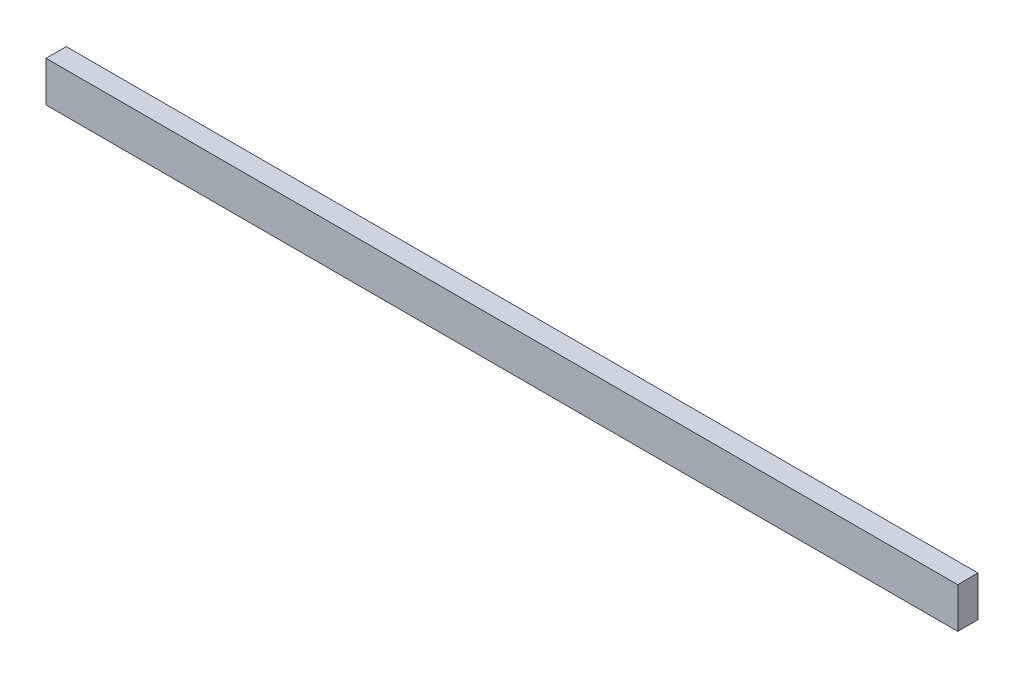
ISO-10303-21;
HEADER;
FILE_DESCRIPTION(('STEP AP214'),'2;1');
FILE_NAME('part.step','',(''),(''),'','','');
FILE_SCHEMA(('AUTOMOTIVE_DESIGN { 1 0 10303 214 1 1 1 1 }'));
ENDSEC;
DATA;
#1=APPLICATION_CONTEXT('core data for automotive mechanical design processes');
#2=APPLICATION_PROTOCOL_DEFINITION('international standard','automotive_design',2000,#1);
#3=PRODUCT_CONTEXT('',#1,'mechanical');
#4=PRODUCT('Part','Part','',(#3));
#5=PRODUCT_RELATED_PRODUCT_CATEGORY('part','',(#4));
#6=PRODUCT_DEFINITION_FORMATION('','',#4);
#7=PRODUCT_DEFINITION_CONTEXT('part definition',#1,'design');
#8=PRODUCT_DEFINITION('design','',#6,#7);
#9=PRODUCT_DEFINITION_SHAPE('','',#8);
#10=(LENGTH_UNIT() NAMED_UNIT(*) SI_UNIT(.MILLI.,.METRE.));
#11=(NAMED_UNIT(*) PLANE_ANGLE_UNIT() SI_UNIT($,.RADIAN.));
#12=(NAMED_UNIT(*) SI_UNIT($,.STERADIAN.) SOLID_ANGLE_UNIT());
#13=UNCERTAINTY_MEASURE_WITH_UNIT(LENGTH_MEASURE(1.E-05),#10,'distance_accuracy_value','');
#14=(GEOMETRIC_REPRESENTATION_CONTEXT(3) GLOBAL_UNCERTAINTY_ASSIGNED_CONTEXT((#13)) GLOBAL_UNIT_ASSIGNED_CONTEXT((#10,
#11,#12)) REPRESENTATION_CONTEXT('',''));
#15=CARTESIAN_POINT('',(0.,0.,0.));
#16=DIRECTION('',(0.,0.,1.));
#17=DIRECTION('',(1.,0.,0.));
#18=AXIS2_PLACEMENT_3D('',#15,#16,#17);
#19=CARTESIAN_POINT('',(338.,15.,15.));
#20=DIRECTION('',(-1.,0.,0.));
#21=DIRECTION('',(0.,0.,1.));
#22=AXIS2_PLACEMENT_3D('',#19,#20,#21);
#23=PLANE('',#22);
#24=DIRECTION('',(0.,1.,0.));
#25=VECTOR('',#24,1.);
#26=CARTESIAN_POINT('',(338.,15.,0.));
#27=LINE('',#26,#25);
#28=CARTESIAN_POINT('',(338.,-15.,0.));
#29=VERTEX_POINT('',#28);
#30=CARTESIAN_POINT('',(338.,15.,0.));
#31=VERTEX_POINT('',#30);
#32=EDGE_CURVE('E96',#29,#31,#27,.T.);
#33=ORIENTED_EDGE('',*,*,#32,.T.);
#34=DIRECTION('',(0.,0.,-1.));
#35=VECTOR('',#34,1.);
#36=CARTESIAN_POINT('',(338.,15.,15.));
#37=LINE('',#36,#35);
#38=CARTESIAN_POINT('',(338.,15.,15.));
#39=VERTEX_POINT('',#38);
#40=EDGE_CURVE('E11',#39,#31,#37,.T.);
#41=ORIENTED_EDGE('',*,*,#40,.F.);
#42=DIRECTION('',(0.,1.,0.));
#43=VECTOR('',#42,1.);
#44=CARTESIAN_POINT('',(338.,15.,15.));
#45=LINE('',#44,#43);
#46=CARTESIAN_POINT('',(338.,-15.,15.));
#47=VERTEX_POINT('',#46);
#48=EDGE_CURVE('E84',#47,#39,#45,.T.);
#49=ORIENTED_EDGE('',*,*,#48,.F.);
#50=DIRECTION('',(0.,0.,-1.));
#51=VECTOR('',#50,1.);
#52=CARTESIAN_POINT('',(338.,-15.,15.));
#53=LINE('',#52,#51);
#54=EDGE_CURVE('E92',#47,#29,#53,.T.);
#55=ORIENTED_EDGE('',*,*,#54,.T.);
#56=EDGE_LOOP('',(#33,#41,#49,#55));
#57=FACE_BOUND('',#56,.T.);
#58=ADVANCED_FACE('F33',(#57),#23,.F.);
#59=CARTESIAN_POINT('',(-338.,15.,15.));
#60=DIRECTION('',(0.,-1.,0.));
#61=DIRECTION('',(0.,0.,-1.));
#62=AXIS2_PLACEMENT_3D('',#59,#60,#61);
#63=PLANE('',#62);
#64=DIRECTION('',(-1.,0.,0.));
#65=VECTOR('',#64,1.);
#66=CARTESIAN_POINT('',(-338.,15.,0.));
#67=LINE('',#66,#65);
#68=CARTESIAN_POINT('',(-338.,15.,0.));
#69=VERTEX_POINT('',#68);
#70=EDGE_CURVE('E88',#31,#69,#67,.T.);
#71=ORIENTED_EDGE('',*,*,#70,.T.);
#72=DIRECTION('',(0.,0.,-1.));
#73=VECTOR('',#72,1.);
#74=CARTESIAN_POINT('',(-338.,15.,15.));
#75=LINE('',#74,#73);
#76=CARTESIAN_POINT('',(-338.,15.,15.));
#77=VERTEX_POINT('',#76);
#78=EDGE_CURVE('E41',#77,#69,#75,.T.);
#79=ORIENTED_EDGE('',*,*,#78,.F.);
#80=DIRECTION('',(-1.,0.,0.));
#81=VECTOR('',#80,1.);
#82=CARTESIAN_POINT('',(-338.,15.,15.));
#83=LINE('',#82,#81);
#84=EDGE_CURVE('E79',#39,#77,#83,.T.);
#85=ORIENTED_EDGE('',*,*,#84,.F.);
#86=ORIENTED_EDGE('',*,*,#40,.T.);
#87=EDGE_LOOP('',(#71,#79,#85,#86));
#88=FACE_BOUND('',#87,.T.);
#89=ADVANCED_FACE('F87',(#88),#63,.F.);
#90=CARTESIAN_POINT('',(-338.,15.,15.));
#91=DIRECTION('',(1.,0.,0.));
#92=DIRECTION('',(0.,0.,-1.));
#93=AXIS2_PLACEMENT_3D('',#90,#91,#92);
#94=PLANE('',#93);
#95=DIRECTION('',(0.,-1.,0.));
#96=VECTOR('',#95,1.);
#97=CARTESIAN_POINT('',(-338.,15.,0.));
#98=LINE('',#97,#96);
#99=CARTESIAN_POINT('',(-338.,-15.,0.));
#100=VERTEX_POINT('',#99);
#101=EDGE_CURVE('E66',#69,#100,#98,.T.);
#102=ORIENTED_EDGE('',*,*,#101,.T.);
#103=DIRECTION('',(0.,0.,-1.));
#104=VECTOR('',#103,1.);
#105=CARTESIAN_POINT('',(-338.,-15.,15.));
#106=LINE('',#105,#104);
#107=CARTESIAN_POINT('',(-338.,-15.,15.));
#108=VERTEX_POINT('',#107);
#109=EDGE_CURVE('E89',#108,#100,#106,.T.);
#110=ORIENTED_EDGE('',*,*,#109,.F.);
#111=DIRECTION('',(0.,-1.,0.));
#112=VECTOR('',#111,1.);
#113=CARTESIAN_POINT('',(-338.,15.,15.));
#114=LINE('',#113,#112);
#115=EDGE_CURVE('E82',#77,#108,#114,.T.);
#116=ORIENTED_EDGE('',*,*,#115,.F.);
#117=ORIENTED_EDGE('',*,*,#78,.T.);
#118=EDGE_LOOP('',(#102,#110,#116,#117));
#119=FACE_BOUND('',#118,.T.);
#120=ADVANCED_FACE('F90',(#119),#94,.F.);
#121=CARTESIAN_POINT('',(-338.,-15.,15.));
#122=DIRECTION('',(0.,1.,0.));
#123=DIRECTION('',(0.,0.,1.));
#124=AXIS2_PLACEMENT_3D('',#121,#122,#123);
#125=PLANE('',#124);
#126=DIRECTION('',(1.,0.,0.));
#127=VECTOR('',#126,1.);
#128=CARTESIAN_POINT('',(-338.,-15.,0.));
#129=LINE('',#128,#127);
#130=EDGE_CURVE('E72',#100,#29,#129,.T.);
#131=ORIENTED_EDGE('',*,*,#130,.T.);
#132=ORIENTED_EDGE('',*,*,#54,.F.);
#133=DIRECTION('',(1.,0.,0.));
#134=VECTOR('',#133,1.);
#135=CARTESIAN_POINT('',(-338.,-15.,15.));
#136=LINE('',#135,#134);
#137=EDGE_CURVE('E49',#108,#47,#136,.T.);
#138=ORIENTED_EDGE('',*,*,#137,.F.);
#139=ORIENTED_EDGE('',*,*,#109,.T.);
#140=EDGE_LOOP('',(#131,#132,#138,#139));
#141=FACE_BOUND('',#140,.T.);
#142=ADVANCED_FACE('F103',(#141),#125,.F.);
#143=CARTESIAN_POINT('',(0.,0.,15.));
#144=DIRECTION('',(0.,0.,1.));
#145=DIRECTION('',(1.,0.,0.));
#146=AXIS2_PLACEMENT_3D('',#143,#144,#145);
#147=PLANE('',#146);
#148=ORIENTED_EDGE('',*,*,#48,.T.);
#149=ORIENTED_EDGE('',*,*,#84,.T.);
#150=ORIENTED_EDGE('',*,*,#115,.T.);
#151=ORIENTED_EDGE('',*,*,#137,.T.);
#152=EDGE_LOOP('',(#148,#149,#150,#151));
#153=FACE_BOUND('',#152,.T.);
#154=ADVANCED_FACE('F80',(#153),#147,.T.);
#155=CARTESIAN_POINT('',(0.,0.,0.));
#156=DIRECTION('',(0.,0.,1.));
#157=DIRECTION('',(1.,0.,0.));
#158=AXIS2_PLACEMENT_3D('',#155,#156,#157);
#159=PLANE('',#158);
#160=ORIENTED_EDGE('',*,*,#32,.F.);
#161=ORIENTED_EDGE('',*,*,#130,.F.);
#162=ORIENTED_EDGE('',*,*,#101,.F.);
#163=ORIENTED_EDGE('',*,*,#70,.F.);
#164=EDGE_LOOP('',(#160,#161,#162,#163));
#165=FACE_BOUND('',#164,.T.);
#166=ADVANCED_FACE('F106',(#165),#159,.F.);
#167=CLOSED_SHELL('',(#58,#89,#120,#142,#154,#166));
#168=MANIFOLD_SOLID_BREP('B2',#167);
#169=ADVANCED_BREP_SHAPE_REPRESENTATION('',(#18,#168),#14);
#170=SHAPE_DEFINITION_REPRESENTATION(#9,#169);
ENDSEC;
END-ISO-10303-21;
